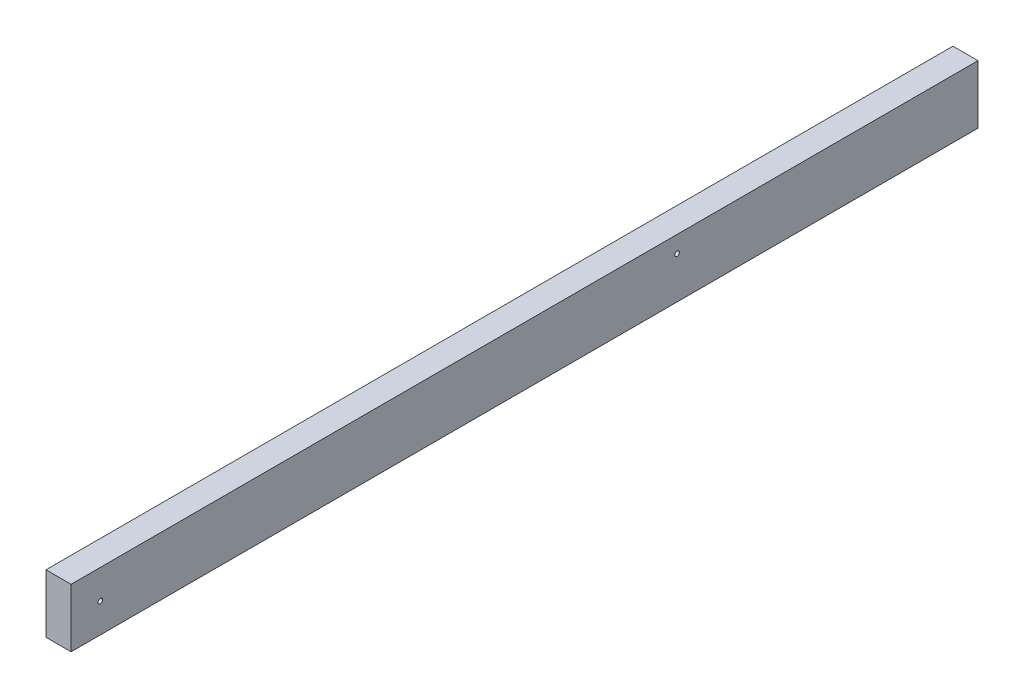
ISO-10303-21;
HEADER;
FILE_DESCRIPTION(('STEP AP214'),'2;1');
FILE_NAME('part.step','',(''),(''),'','','');
FILE_SCHEMA(('AUTOMOTIVE_DESIGN { 1 0 10303 214 1 1 1 1 }'));
ENDSEC;
DATA;
#1=APPLICATION_CONTEXT('core data for automotive mechanical design processes');
#2=APPLICATION_PROTOCOL_DEFINITION('international standard','automotive_design',2000,#1);
#3=PRODUCT_CONTEXT('',#1,'mechanical');
#4=PRODUCT('Part','Part','',(#3));
#5=PRODUCT_RELATED_PRODUCT_CATEGORY('part','',(#4));
#6=PRODUCT_DEFINITION_FORMATION('','',#4);
#7=PRODUCT_DEFINITION_CONTEXT('part definition',#1,'design');
#8=PRODUCT_DEFINITION('design','',#6,#7);
#9=PRODUCT_DEFINITION_SHAPE('','',#8);
#10=(LENGTH_UNIT() NAMED_UNIT(*) SI_UNIT(.MILLI.,.METRE.));
#11=(NAMED_UNIT(*) PLANE_ANGLE_UNIT() SI_UNIT($,.RADIAN.));
#12=(NAMED_UNIT(*) SI_UNIT($,.STERADIAN.) SOLID_ANGLE_UNIT());
#13=UNCERTAINTY_MEASURE_WITH_UNIT(LENGTH_MEASURE(1.E-05),#10,'distance_accuracy_value','');
#14=(GEOMETRIC_REPRESENTATION_CONTEXT(3) GLOBAL_UNCERTAINTY_ASSIGNED_CONTEXT((#13)) GLOBAL_UNIT_ASSIGNED_CONTEXT((#10,
#11,#12)) REPRESENTATION_CONTEXT('',''));
#15=CARTESIAN_POINT('',(0.,0.,0.));
#16=DIRECTION('',(0.,0.,1.));
#17=DIRECTION('',(1.,0.,0.));
#18=AXIS2_PLACEMENT_3D('',#15,#16,#17);
#19=CARTESIAN_POINT('',(19.05,-44.45,1377.95));
#20=DIRECTION('',(-1.,0.,0.));
#21=DIRECTION('',(0.,0.,1.));
#22=AXIS2_PLACEMENT_3D('',#19,#20,#21);
#23=PLANE('',#22);
#24=CARTESIAN_POINT('',(19.05,0.,1333.5));
#25=DIRECTION('',(1.,0.,0.));
#26=DIRECTION('',(0.,0.,-1.));
#27=AXIS2_PLACEMENT_3D('',#24,#25,#26);
#28=CIRCLE('',#27,3.571875);
#29=CARTESIAN_POINT('',(19.05,0.,1329.928125));
#30=VERTEX_POINT('',#29);
#31=EDGE_CURVE('E118',#30,#30,#28,.T.);
#32=ORIENTED_EDGE('',*,*,#31,.F.);
#33=EDGE_LOOP('',(#32));
#34=FACE_BOUND('',#33,.T.);
#35=CARTESIAN_POINT('',(19.05,19.05,457.2));
#36=DIRECTION('',(1.,0.,0.));
#37=DIRECTION('',(0.,0.,-1.));
#38=AXIS2_PLACEMENT_3D('',#35,#36,#37);
#39=CIRCLE('',#38,3.571875);
#40=CARTESIAN_POINT('',(19.05,19.05,453.628125));
#41=VERTEX_POINT('',#40);
#42=EDGE_CURVE('E112',#41,#41,#39,.T.);
#43=ORIENTED_EDGE('',*,*,#42,.F.);
#44=EDGE_LOOP('',(#43));
#45=FACE_BOUND('',#44,.T.);
#46=DIRECTION('',(0.,1.,0.));
#47=VECTOR('',#46,1.);
#48=CARTESIAN_POINT('',(19.05,-44.45,0.));
#49=LINE('',#48,#47);
#50=CARTESIAN_POINT('',(19.05,-44.45,0.));
#51=VERTEX_POINT('',#50);
#52=CARTESIAN_POINT('',(19.05,44.45,0.));
#53=VERTEX_POINT('',#52);
#54=EDGE_CURVE('E96',#51,#53,#49,.T.);
#55=ORIENTED_EDGE('',*,*,#54,.T.);
#56=DIRECTION('',(0.,0.,-1.));
#57=VECTOR('',#56,1.);
#58=CARTESIAN_POINT('',(19.05,44.45,1377.95));
#59=LINE('',#58,#57);
#60=CARTESIAN_POINT('',(19.05,44.45,1377.95));
#61=VERTEX_POINT('',#60);
#62=EDGE_CURVE('E11',#61,#53,#59,.T.);
#63=ORIENTED_EDGE('',*,*,#62,.F.);
#64=DIRECTION('',(0.,1.,0.));
#65=VECTOR('',#64,1.);
#66=CARTESIAN_POINT('',(19.05,-44.45,1377.95));
#67=LINE('',#66,#65);
#68=CARTESIAN_POINT('',(19.05,-44.45,1377.95));
#69=VERTEX_POINT('',#68);
#70=EDGE_CURVE('E84',#69,#61,#67,.T.);
#71=ORIENTED_EDGE('',*,*,#70,.F.);
#72=DIRECTION('',(0.,0.,-1.));
#73=VECTOR('',#72,1.);
#74=CARTESIAN_POINT('',(19.05,-44.45,1377.95));
#75=LINE('',#74,#73);
#76=EDGE_CURVE('E92',#69,#51,#75,.T.);
#77=ORIENTED_EDGE('',*,*,#76,.T.);
#78=EDGE_LOOP('',(#55,#63,#71,#77));
#79=FACE_BOUND('',#78,.T.);
#80=ADVANCED_FACE('F33',(#34,#45,#79),#23,.F.);
#81=CARTESIAN_POINT('',(-19.05,44.45,1377.95));
#82=DIRECTION('',(0.,-1.,0.));
#83=DIRECTION('',(0.,0.,-1.));
#84=AXIS2_PLACEMENT_3D('',#81,#82,#83);
#85=PLANE('',#84);
#86=DIRECTION('',(-1.,0.,0.));
#87=VECTOR('',#86,1.);
#88=CARTESIAN_POINT('',(-19.05,44.45,0.));
#89=LINE('',#88,#87);
#90=CARTESIAN_POINT('',(-19.05,44.45,0.));
#91=VERTEX_POINT('',#90);
#92=EDGE_CURVE('E88',#53,#91,#89,.T.);
#93=ORIENTED_EDGE('',*,*,#92,.T.);
#94=DIRECTION('',(0.,0.,-1.));
#95=VECTOR('',#94,1.);
#96=CARTESIAN_POINT('',(-19.05,44.45,1377.95));
#97=LINE('',#96,#95);
#98=CARTESIAN_POINT('',(-19.05,44.45,1377.95));
#99=VERTEX_POINT('',#98);
#100=EDGE_CURVE('E41',#99,#91,#97,.T.);
#101=ORIENTED_EDGE('',*,*,#100,.F.);
#102=DIRECTION('',(-1.,0.,0.));
#103=VECTOR('',#102,1.);
#104=CARTESIAN_POINT('',(-19.05,44.45,1377.95));
#105=LINE('',#104,#103);
#106=EDGE_CURVE('E79',#61,#99,#105,.T.);
#107=ORIENTED_EDGE('',*,*,#106,.F.);
#108=ORIENTED_EDGE('',*,*,#62,.T.);
#109=EDGE_LOOP('',(#93,#101,#107,#108));
#110=FACE_BOUND('',#109,.T.);
#111=ADVANCED_FACE('F87',(#110),#85,.F.);
#112=CARTESIAN_POINT('',(-19.05,-44.45,1377.95));
#113=DIRECTION('',(1.,0.,0.));
#114=DIRECTION('',(0.,0.,-1.));
#115=AXIS2_PLACEMENT_3D('',#112,#113,#114);
#116=PLANE('',#115);
#117=CARTESIAN_POINT('',(-19.05,0.,1333.5));
#118=DIRECTION('',(1.,0.,0.));
#119=DIRECTION('',(0.,0.,-1.));
#120=AXIS2_PLACEMENT_3D('',#117,#118,#119);
#121=CIRCLE('',#120,3.57187499999999);
#122=CARTESIAN_POINT('',(-19.05,0.,1329.928125));
#123=VERTEX_POINT('',#122);
#124=EDGE_CURVE('E115',#123,#123,#121,.T.);
#125=ORIENTED_EDGE('',*,*,#124,.T.);
#126=EDGE_LOOP('',(#125));
#127=FACE_BOUND('',#126,.T.);
#128=CARTESIAN_POINT('',(-19.05,19.05,457.2));
#129=DIRECTION('',(1.,0.,0.));
#130=DIRECTION('',(0.,0.,-1.));
#131=AXIS2_PLACEMENT_3D('',#128,#129,#130);
#132=CIRCLE('',#131,3.57187499999999);
#133=CARTESIAN_POINT('',(-19.05,19.05,453.628125));
#134=VERTEX_POINT('',#133);
#135=EDGE_CURVE('E99',#134,#134,#132,.T.);
#136=ORIENTED_EDGE('',*,*,#135,.T.);
#137=EDGE_LOOP('',(#136));
#138=FACE_BOUND('',#137,.T.);
#139=DIRECTION('',(0.,-1.,0.));
#140=VECTOR('',#139,1.);
#141=CARTESIAN_POINT('',(-19.05,-44.45,0.));
#142=LINE('',#141,#140);
#143=CARTESIAN_POINT('',(-19.05,-44.45,0.));
#144=VERTEX_POINT('',#143);
#145=EDGE_CURVE('E66',#91,#144,#142,.T.);
#146=ORIENTED_EDGE('',*,*,#145,.T.);
#147=DIRECTION('',(0.,0.,-1.));
#148=VECTOR('',#147,1.);
#149=CARTESIAN_POINT('',(-19.05,-44.45,1377.95));
#150=LINE('',#149,#148);
#151=CARTESIAN_POINT('',(-19.05,-44.45,1377.95));
#152=VERTEX_POINT('',#151);
#153=EDGE_CURVE('E89',#152,#144,#150,.T.);
#154=ORIENTED_EDGE('',*,*,#153,.F.);
#155=DIRECTION('',(0.,-1.,0.));
#156=VECTOR('',#155,1.);
#157=CARTESIAN_POINT('',(-19.05,-44.45,1377.95));
#158=LINE('',#157,#156);
#159=EDGE_CURVE('E82',#99,#152,#158,.T.);
#160=ORIENTED_EDGE('',*,*,#159,.F.);
#161=ORIENTED_EDGE('',*,*,#100,.T.);
#162=EDGE_LOOP('',(#146,#154,#160,#161));
#163=FACE_BOUND('',#162,.T.);
#164=ADVANCED_FACE('F90',(#127,#138,#163),#116,.F.);
#165=CARTESIAN_POINT('',(-19.05,-44.45,1377.95));
#166=DIRECTION('',(0.,1.,0.));
#167=DIRECTION('',(0.,0.,1.));
#168=AXIS2_PLACEMENT_3D('',#165,#166,#167);
#169=PLANE('',#168);
#170=DIRECTION('',(1.,0.,0.));
#171=VECTOR('',#170,1.);
#172=CARTESIAN_POINT('',(-19.05,-44.45,0.));
#173=LINE('',#172,#171);
#174=EDGE_CURVE('E72',#144,#51,#173,.T.);
#175=ORIENTED_EDGE('',*,*,#174,.T.);
#176=ORIENTED_EDGE('',*,*,#76,.F.);
#177=DIRECTION('',(1.,0.,0.));
#178=VECTOR('',#177,1.);
#179=CARTESIAN_POINT('',(-19.05,-44.45,1377.95));
#180=LINE('',#179,#178);
#181=EDGE_CURVE('E49',#152,#69,#180,.T.);
#182=ORIENTED_EDGE('',*,*,#181,.F.);
#183=ORIENTED_EDGE('',*,*,#153,.T.);
#184=EDGE_LOOP('',(#175,#176,#182,#183));
#185=FACE_BOUND('',#184,.T.);
#186=ADVANCED_FACE('F104',(#185),#169,.F.);
#187=CARTESIAN_POINT('',(0.,0.,1377.95));
#188=DIRECTION('',(0.,0.,-1.));
#189=DIRECTION('',(-1.,0.,0.));
#190=AXIS2_PLACEMENT_3D('',#187,#188,#189);
#191=PLANE('',#190);
#192=ORIENTED_EDGE('',*,*,#70,.T.);
#193=ORIENTED_EDGE('',*,*,#106,.T.);
#194=ORIENTED_EDGE('',*,*,#159,.T.);
#195=ORIENTED_EDGE('',*,*,#181,.T.);
#196=EDGE_LOOP('',(#192,#193,#194,#195));
#197=FACE_BOUND('',#196,.T.);
#198=ADVANCED_FACE('F80',(#197),#191,.F.);
#199=CARTESIAN_POINT('',(0.,0.,0.));
#200=DIRECTION('',(0.,0.,-1.));
#201=DIRECTION('',(-1.,0.,0.));
#202=AXIS2_PLACEMENT_3D('',#199,#200,#201);
#203=PLANE('',#202);
#204=ORIENTED_EDGE('',*,*,#54,.F.);
#205=ORIENTED_EDGE('',*,*,#174,.F.);
#206=ORIENTED_EDGE('',*,*,#145,.F.);
#207=ORIENTED_EDGE('',*,*,#92,.F.);
#208=EDGE_LOOP('',(#204,#205,#206,#207));
#209=FACE_BOUND('',#208,.T.);
#210=ADVANCED_FACE('F107',(#209),#203,.T.);
#211=CARTESIAN_POINT('',(19.05,19.05,457.2));
#212=DIRECTION('',(1.,0.,0.));
#213=DIRECTION('',(0.,0.,-1.));
#214=AXIS2_PLACEMENT_3D('',#211,#212,#213);
#215=CYLINDRICAL_SURFACE('',#214,3.57187499999999);
#216=ORIENTED_EDGE('',*,*,#135,.F.);
#217=EDGE_LOOP('',(#216));
#218=FACE_BOUND('',#217,.T.);
#219=ORIENTED_EDGE('',*,*,#42,.T.);
#220=EDGE_LOOP('',(#219));
#221=FACE_BOUND('',#220,.T.);
#222=ADVANCED_FACE('F128',(#218,#221),#215,.F.);
#223=CARTESIAN_POINT('',(19.05,0.,1333.5));
#224=DIRECTION('',(1.,0.,0.));
#225=DIRECTION('',(0.,0.,-1.));
#226=AXIS2_PLACEMENT_3D('',#223,#224,#225);
#227=CYLINDRICAL_SURFACE('',#226,3.57187499999999);
#228=ORIENTED_EDGE('',*,*,#124,.F.);
#229=EDGE_LOOP('',(#228));
#230=FACE_BOUND('',#229,.T.);
#231=ORIENTED_EDGE('',*,*,#31,.T.);
#232=EDGE_LOOP('',(#231));
#233=FACE_BOUND('',#232,.T.);
#234=ADVANCED_FACE('F122',(#230,#233),#227,.F.);
#235=CLOSED_SHELL('',(#80,#111,#164,#186,#198,#210,#222,#234));
#236=MANIFOLD_SOLID_BREP('B2',#235);
#237=ADVANCED_BREP_SHAPE_REPRESENTATION('',(#18,#236),#14);
#238=SHAPE_DEFINITION_REPRESENTATION(#9,#237);
ENDSEC;
END-ISO-10303-21;
